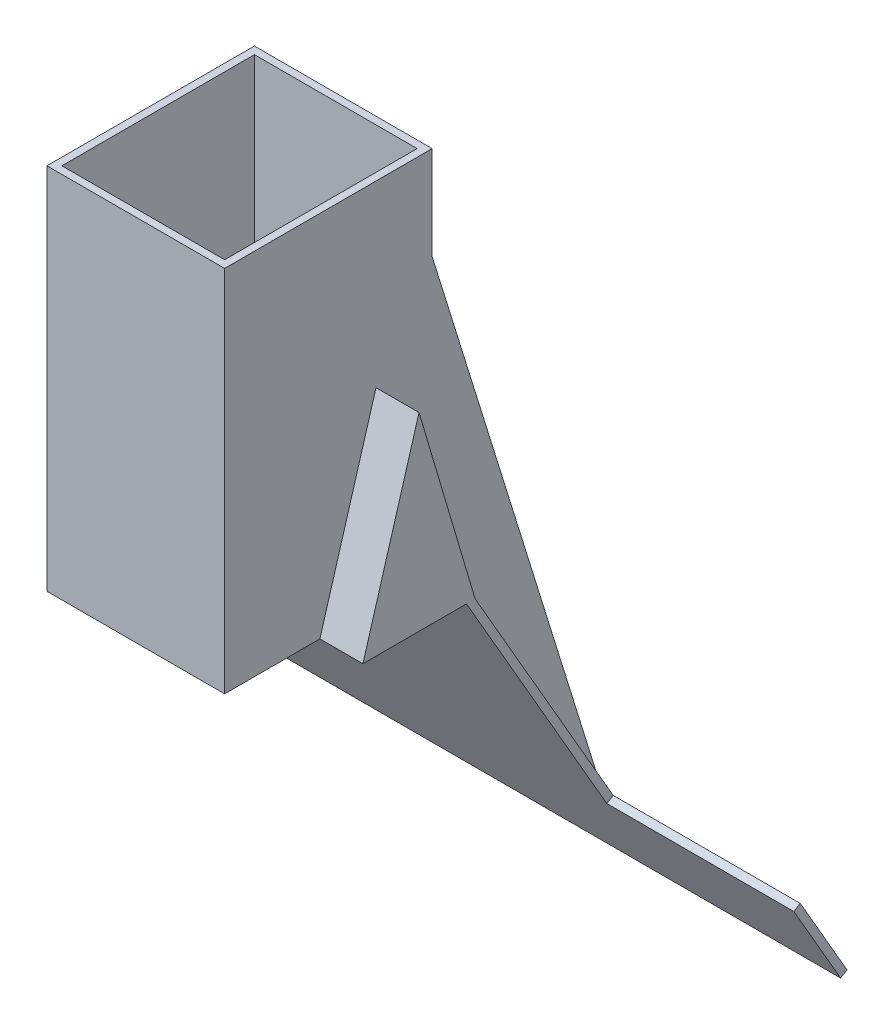
ISO-10303-21;
HEADER;
FILE_DESCRIPTION(('STEP AP214'),'2;1');
FILE_NAME('part.step','',(''),(''),'','','');
FILE_SCHEMA(('AUTOMOTIVE_DESIGN { 1 0 10303 214 1 1 1 1 }'));
ENDSEC;
DATA;
#1=APPLICATION_CONTEXT('core data for automotive mechanical design processes');
#2=APPLICATION_PROTOCOL_DEFINITION('international standard','automotive_design',2000,#1);
#3=PRODUCT_CONTEXT('',#1,'mechanical');
#4=PRODUCT('Part','Part','',(#3));
#5=PRODUCT_RELATED_PRODUCT_CATEGORY('part','',(#4));
#6=PRODUCT_DEFINITION_FORMATION('','',#4);
#7=PRODUCT_DEFINITION_CONTEXT('part definition',#1,'design');
#8=PRODUCT_DEFINITION('design','',#6,#7);
#9=PRODUCT_DEFINITION_SHAPE('','',#8);
#10=(LENGTH_UNIT() NAMED_UNIT(*) SI_UNIT(.MILLI.,.METRE.));
#11=(NAMED_UNIT(*) PLANE_ANGLE_UNIT() SI_UNIT($,.RADIAN.));
#12=(NAMED_UNIT(*) SI_UNIT($,.STERADIAN.) SOLID_ANGLE_UNIT());
#13=UNCERTAINTY_MEASURE_WITH_UNIT(LENGTH_MEASURE(1.E-05),#10,'distance_accuracy_value','');
#14=(GEOMETRIC_REPRESENTATION_CONTEXT(3) GLOBAL_UNCERTAINTY_ASSIGNED_CONTEXT((#13)) GLOBAL_UNIT_ASSIGNED_CONTEXT((#10,
#11,#12)) REPRESENTATION_CONTEXT('',''));
#15=CARTESIAN_POINT('',(0.,0.,0.));
#16=DIRECTION('',(0.,0.,1.));
#17=DIRECTION('',(1.,0.,0.));
#18=AXIS2_PLACEMENT_3D('',#15,#16,#17);
#19=CARTESIAN_POINT('',(11.8,0.,0.));
#20=DIRECTION('',(-1.,0.,0.));
#21=DIRECTION('',(0.,0.,-1.));
#22=AXIS2_PLACEMENT_3D('',#19,#20,#21);
#23=PLANE('',#22);
#24=DIRECTION('',(0.,-0.5,0.866025403784439));
#25=VECTOR('',#24,1.);
#26=CARTESIAN_POINT('',(11.8,-12.7903810567666,-18.4775299461621));
#27=LINE('',#26,#25);
#28=CARTESIAN_POINT('',(11.8,-12.7903810567666,-18.4775299461621));
#29=VERTEX_POINT('',#28);
#30=CARTESIAN_POINT('',(11.8,-12.9903810567666,-18.1311197846483));
#31=VERTEX_POINT('',#30);
#32=EDGE_CURVE('E57',#29,#31,#27,.T.);
#33=ORIENTED_EDGE('',*,*,#32,.F.);
#34=DIRECTION('',(0.,-0.866025403784438,-0.5));
#35=VECTOR('',#34,1.);
#36=CARTESIAN_POINT('',(11.8,-17.1205080756888,-20.9775299461621));
#37=LINE('',#36,#35);
#38=CARTESIAN_POINT('',(11.8,0.,-11.093));
#39=VERTEX_POINT('',#38);
#40=EDGE_CURVE('E364',#39,#29,#37,.T.);
#41=ORIENTED_EDGE('',*,*,#40,.F.);
#42=DIRECTION('',(0.,-0.958836299508464,-0.283959417426001));
#43=VECTOR('',#42,1.);
#44=CARTESIAN_POINT('',(11.8,0.,-11.093));
#45=LINE('',#44,#43);
#46=CARTESIAN_POINT('',(11.8,10.13,-8.093));
#47=VERTEX_POINT('',#46);
#48=EDGE_CURVE('E496',#47,#39,#45,.T.);
#49=ORIENTED_EDGE('',*,*,#48,.F.);
#50=DIRECTION('',(0.,0.958836299508464,-0.283959417426001));
#51=VECTOR('',#50,1.);
#52=CARTESIAN_POINT('',(11.8,10.13,-8.093));
#53=LINE('',#52,#51);
#54=CARTESIAN_POINT('',(11.8,0.,-5.093));
#55=VERTEX_POINT('',#54);
#56=EDGE_CURVE('E501',#55,#47,#53,.T.);
#57=ORIENTED_EDGE('',*,*,#56,.F.);
#58=DIRECTION('',(0.,0.,1.));
#59=VECTOR('',#58,1.);
#60=CARTESIAN_POINT('',(11.8,0.,-5.093));
#61=LINE('',#60,#59);
#62=CARTESIAN_POINT('',(11.8,0.,-10.6311197846483));
#63=VERTEX_POINT('',#62);
#64=EDGE_CURVE('E493',#63,#55,#61,.T.);
#65=ORIENTED_EDGE('',*,*,#64,.F.);
#66=DIRECTION('',(0.,0.866025403784439,0.5));
#67=VECTOR('',#66,1.);
#68=CARTESIAN_POINT('',(11.8,-17.3205080756888,-20.6311197846483));
#69=LINE('',#68,#67);
#70=EDGE_CURVE('E367',#31,#63,#69,.T.);
#71=ORIENTED_EDGE('',*,*,#70,.F.);
#72=EDGE_LOOP('',(#33,#41,#49,#57,#65,#71));
#73=FACE_BOUND('',#72,.T.);
#74=ADVANCED_FACE('F41',(#73),#23,.F.);
#75=CARTESIAN_POINT('',(9.1,19.7,-5.5));
#76=DIRECTION('',(0.,0.,-1.));
#77=DIRECTION('',(-1.,0.,0.));
#78=AXIS2_PLACEMENT_3D('',#75,#76,#77);
#79=PLANE('',#78);
#80=DIRECTION('',(0.,1.,0.));
#81=VECTOR('',#80,1.);
#82=CARTESIAN_POINT('',(0.4,-17.3215080756888,-5.5));
#83=LINE('',#82,#81);
#84=CARTESIAN_POINT('',(0.399999999999999,0.,-5.5));
#85=VERTEX_POINT('',#84);
#86=CARTESIAN_POINT('',(0.399999999999999,0.4,-5.5));
#87=VERTEX_POINT('',#86);
#88=EDGE_CURVE('E338',#85,#87,#83,.T.);
#89=ORIENTED_EDGE('',*,*,#88,.F.);
#90=DIRECTION('',(1.,0.,0.));
#91=VECTOR('',#90,1.);
#92=CARTESIAN_POINT('',(9.1,0.,-5.5));
#93=LINE('',#92,#91);
#94=CARTESIAN_POINT('',(-1.9,0.,-5.5));
#95=VERTEX_POINT('',#94);
#96=EDGE_CURVE('E557',#95,#85,#93,.T.);
#97=ORIENTED_EDGE('',*,*,#96,.F.);
#98=DIRECTION('',(0.,-1.,0.));
#99=VECTOR('',#98,1.);
#100=CARTESIAN_POINT('',(-1.9,0.4,-5.5));
#101=LINE('',#100,#99);
#102=CARTESIAN_POINT('',(-1.9,0.4,-5.5));
#103=VERTEX_POINT('',#102);
#104=EDGE_CURVE('E412',#103,#95,#101,.T.);
#105=ORIENTED_EDGE('',*,*,#104,.F.);
#106=DIRECTION('',(-1.,0.,0.));
#107=VECTOR('',#106,1.);
#108=CARTESIAN_POINT('',(-1.9,0.4,-5.5));
#109=LINE('',#108,#107);
#110=EDGE_CURVE('E398',#87,#103,#109,.T.);
#111=ORIENTED_EDGE('',*,*,#110,.F.);
#112=EDGE_LOOP('',(#89,#97,#105,#111));
#113=FACE_BOUND('',#112,.T.);
#114=ADVANCED_FACE('F709',(#113),#79,.T.);
#115=CARTESIAN_POINT('',(11.8,-17.1205080756888,-20.9775299461621));
#116=DIRECTION('',(0.,0.5,-0.866025403784439));
#117=DIRECTION('',(0.,0.866025403784439,0.5));
#118=AXIS2_PLACEMENT_3D('',#115,#116,#117);
#119=PLANE('',#118);
#120=DIRECTION('',(1.,0.,0.));
#121=VECTOR('',#120,1.);
#122=CARTESIAN_POINT('',(-2.3,0.,-11.093));
#123=LINE('',#122,#121);
#124=CARTESIAN_POINT('',(-2.3,0.,-11.093));
#125=VERTEX_POINT('',#124);
#126=CARTESIAN_POINT('',(0.,0.,-11.093));
#127=VERTEX_POINT('',#126);
#128=EDGE_CURVE('E533',#125,#127,#123,.T.);
#129=ORIENTED_EDGE('',*,*,#128,.T.);
#130=DIRECTION('',(0.,0.866025403784438,0.5));
#131=VECTOR('',#130,1.);
#132=CARTESIAN_POINT('',(0.,-17.1205080756888,-20.9775299461621));
#133=LINE('',#132,#131);
#134=CARTESIAN_POINT('',(0.,-17.1205080756888,-20.9775299461621));
#135=VERTEX_POINT('',#134);
#136=EDGE_CURVE('E349',#135,#127,#133,.T.);
#137=ORIENTED_EDGE('',*,*,#136,.F.);
#138=DIRECTION('',(-1.,0.,0.));
#139=VECTOR('',#138,1.);
#140=CARTESIAN_POINT('',(11.8,-17.1205080756888,-20.9775299461621));
#141=LINE('',#140,#139);
#142=CARTESIAN_POINT('',(-12.3,-17.1205080756888,-20.9775299461621));
#143=VERTEX_POINT('',#142);
#144=EDGE_CURVE('E283',#135,#143,#141,.T.);
#145=ORIENTED_EDGE('',*,*,#144,.T.);
#146=DIRECTION('',(0.,-0.866025403784438,-0.5));
#147=VECTOR('',#146,1.);
#148=CARTESIAN_POINT('',(-12.3,-17.1205080756888,-20.9775299461621));
#149=LINE('',#148,#147);
#150=CARTESIAN_POINT('',(-12.3,-12.7903810567666,-18.4775299461621));
#151=VERTEX_POINT('',#150);
#152=EDGE_CURVE('E317',#151,#143,#149,.T.);
#153=ORIENTED_EDGE('',*,*,#152,.F.);
#154=DIRECTION('',(-1.,0.,0.));
#155=VECTOR('',#154,1.);
#156=CARTESIAN_POINT('',(-2.3,-12.7903810567666,-18.4775299461621));
#157=LINE('',#156,#155);
#158=CARTESIAN_POINT('',(-2.3,-12.7903810567666,-18.4775299461621));
#159=VERTEX_POINT('',#158);
#160=EDGE_CURVE('E313',#159,#151,#157,.T.);
#161=ORIENTED_EDGE('',*,*,#160,.F.);
#162=DIRECTION('',(0.,-0.866025403784438,-0.5));
#163=VECTOR('',#162,1.);
#164=CARTESIAN_POINT('',(-2.3,-17.1205080756888,-20.9775299461621));
#165=LINE('',#164,#163);
#166=EDGE_CURVE('E361',#125,#159,#165,.T.);
#167=ORIENTED_EDGE('',*,*,#166,.F.);
#168=EDGE_LOOP('',(#129,#137,#145,#153,#161,#167));
#169=FACE_BOUND('',#168,.T.);
#170=ADVANCED_FACE('F665',(#169),#119,.T.);
#171=CARTESIAN_POINT('',(0.,19.7,0.));
#172=DIRECTION('',(1.,0.,0.));
#173=DIRECTION('',(0.,0.,-1.));
#174=AXIS2_PLACEMENT_3D('',#171,#172,#173);
#175=PLANE('',#174);
#176=DIRECTION('',(0.,-0.958836299508464,-0.283959417426001));
#177=VECTOR('',#176,1.);
#178=CARTESIAN_POINT('',(0.,0.,-11.093));
#179=LINE('',#178,#177);
#180=CARTESIAN_POINT('',(0.,10.13,-8.093));
#181=VERTEX_POINT('',#180);
#182=EDGE_CURVE('E526',#181,#127,#179,.T.);
#183=ORIENTED_EDGE('',*,*,#182,.F.);
#184=DIRECTION('',(0.,0.958836299508464,-0.283959417426001));
#185=VECTOR('',#184,1.);
#186=CARTESIAN_POINT('',(0.,10.13,-8.093));
#187=LINE('',#186,#185);
#188=CARTESIAN_POINT('',(0.,0.,-5.093));
#189=VERTEX_POINT('',#188);
#190=EDGE_CURVE('E521',#189,#181,#187,.T.);
#191=ORIENTED_EDGE('',*,*,#190,.F.);
#192=DIRECTION('',(0.,0.,1.));
#193=VECTOR('',#192,1.);
#194=CARTESIAN_POINT('',(0.,0.,0.));
#195=LINE('',#194,#193);
#196=CARTESIAN_POINT('',(0.,0.,0.));
#197=VERTEX_POINT('',#196);
#198=EDGE_CURVE('E598',#189,#197,#195,.T.);
#199=ORIENTED_EDGE('',*,*,#198,.T.);
#200=DIRECTION('',(0.,-1.,0.));
#201=VECTOR('',#200,1.);
#202=CARTESIAN_POINT('',(0.,19.7,0.));
#203=LINE('',#202,#201);
#204=CARTESIAN_POINT('',(0.,19.7,0.));
#205=VERTEX_POINT('',#204);
#206=EDGE_CURVE('E11',#205,#197,#203,.T.);
#207=ORIENTED_EDGE('',*,*,#206,.F.);
#208=DIRECTION('',(0.,0.,1.));
#209=VECTOR('',#208,1.);
#210=CARTESIAN_POINT('',(0.,19.7,0.));
#211=LINE('',#210,#209);
#212=CARTESIAN_POINT('',(0.,19.7,-11.093));
#213=VERTEX_POINT('',#212);
#214=EDGE_CURVE('E599',#213,#205,#211,.T.);
#215=ORIENTED_EDGE('',*,*,#214,.F.);
#216=DIRECTION('',(0.,-1.,0.));
#217=VECTOR('',#216,1.);
#218=CARTESIAN_POINT('',(0.,19.7,-11.093));
#219=LINE('',#218,#217);
#220=CARTESIAN_POINT('',(0.,14.7,-11.093));
#221=VERTEX_POINT('',#220);
#222=EDGE_CURVE('E613',#213,#221,#219,.T.);
#223=ORIENTED_EDGE('',*,*,#222,.T.);
#224=DIRECTION('',(0.,-0.954985944356835,-0.296651051036202));
#225=VECTOR('',#224,1.);
#226=CARTESIAN_POINT('',(0.,14.7,-11.093));
#227=LINE('',#226,#225);
#228=EDGE_CURVE('E341',#221,#135,#227,.T.);
#229=ORIENTED_EDGE('',*,*,#228,.T.);
#230=ORIENTED_EDGE('',*,*,#136,.T.);
#231=EDGE_LOOP('',(#183,#191,#199,#207,#215,#223,#229,#230));
#232=FACE_BOUND('',#231,.T.);
#233=ADVANCED_FACE('F43',(#232),#175,.F.);
#234=CARTESIAN_POINT('',(0.,19.7,0.));
#235=DIRECTION('',(0.,-1.,0.));
#236=DIRECTION('',(0.,0.,-1.));
#237=AXIS2_PLACEMENT_3D('',#234,#235,#236);
#238=PLANE('',#237);
#239=ORIENTED_EDGE('',*,*,#214,.T.);
#240=DIRECTION('',(1.,0.,0.));
#241=VECTOR('',#240,1.);
#242=CARTESIAN_POINT('',(0.,19.7,0.));
#243=LINE('',#242,#241);
#244=CARTESIAN_POINT('',(9.5,19.7,0.));
#245=VERTEX_POINT('',#244);
#246=EDGE_CURVE('E603',#205,#245,#243,.T.);
#247=ORIENTED_EDGE('',*,*,#246,.T.);
#248=DIRECTION('',(0.,0.,-1.));
#249=VECTOR('',#248,1.);
#250=CARTESIAN_POINT('',(9.5,19.7,0.));
#251=LINE('',#250,#249);
#252=CARTESIAN_POINT('',(9.5,19.7,-11.093));
#253=VERTEX_POINT('',#252);
#254=EDGE_CURVE('E607',#245,#253,#251,.T.);
#255=ORIENTED_EDGE('',*,*,#254,.T.);
#256=DIRECTION('',(-1.,0.,0.));
#257=VECTOR('',#256,1.);
#258=CARTESIAN_POINT('',(0.,19.7,-11.093));
#259=LINE('',#258,#257);
#260=EDGE_CURVE('E610',#253,#213,#259,.T.);
#261=ORIENTED_EDGE('',*,*,#260,.T.);
#262=EDGE_LOOP('',(#239,#247,#255,#261));
#263=FACE_BOUND('',#262,.T.);
#264=DIRECTION('',(0.,0.,1.));
#265=VECTOR('',#264,1.);
#266=CARTESIAN_POINT('',(0.4,19.7,-0.4));
#267=LINE('',#266,#265);
#268=CARTESIAN_POINT('',(0.4,19.7,-10.693));
#269=VERTEX_POINT('',#268);
#270=CARTESIAN_POINT('',(0.4,19.7,-0.4));
#271=VERTEX_POINT('',#270);
#272=EDGE_CURVE('E578',#269,#271,#267,.T.);
#273=ORIENTED_EDGE('',*,*,#272,.F.);
#274=DIRECTION('',(-1.,0.,0.));
#275=VECTOR('',#274,1.);
#276=CARTESIAN_POINT('',(0.4,19.7,-10.693));
#277=LINE('',#276,#275);
#278=CARTESIAN_POINT('',(9.1,19.7,-10.693));
#279=VERTEX_POINT('',#278);
#280=EDGE_CURVE('E551',#279,#269,#277,.T.);
#281=ORIENTED_EDGE('',*,*,#280,.F.);
#282=DIRECTION('',(0.,0.,-1.));
#283=VECTOR('',#282,1.);
#284=CARTESIAN_POINT('',(9.1,19.7,-0.4));
#285=LINE('',#284,#283);
#286=CARTESIAN_POINT('',(9.1,19.7,-0.4));
#287=VERTEX_POINT('',#286);
#288=EDGE_CURVE('E574',#287,#279,#285,.T.);
#289=ORIENTED_EDGE('',*,*,#288,.F.);
#290=DIRECTION('',(1.,0.,0.));
#291=VECTOR('',#290,1.);
#292=CARTESIAN_POINT('',(0.4,19.7,-0.4));
#293=LINE('',#292,#291);
#294=EDGE_CURVE('E571',#271,#287,#293,.T.);
#295=ORIENTED_EDGE('',*,*,#294,.F.);
#296=EDGE_LOOP('',(#273,#281,#289,#295));
#297=FACE_BOUND('',#296,.T.);
#298=ADVANCED_FACE('F697',(#263,#297),#238,.F.);
#299=CARTESIAN_POINT('',(0.,0.,0.));
#300=DIRECTION('',(0.,-1.,0.));
#301=DIRECTION('',(0.,0.,-1.));
#302=AXIS2_PLACEMENT_3D('',#299,#300,#301);
#303=PLANE('',#302);
#304=ORIENTED_EDGE('',*,*,#96,.T.);
#305=DIRECTION('',(0.,0.,1.));
#306=VECTOR('',#305,1.);
#307=CARTESIAN_POINT('',(0.4,0.,-0.4));
#308=LINE('',#307,#306);
#309=CARTESIAN_POINT('',(0.4,0.,-0.4));
#310=VERTEX_POINT('',#309);
#311=EDGE_CURVE('E575',#85,#310,#308,.T.);
#312=ORIENTED_EDGE('',*,*,#311,.T.);
#313=DIRECTION('',(1.,0.,0.));
#314=VECTOR('',#313,1.);
#315=CARTESIAN_POINT('',(0.4,0.,-0.4));
#316=LINE('',#315,#314);
#317=CARTESIAN_POINT('',(9.1,0.,-0.4));
#318=VERTEX_POINT('',#317);
#319=EDGE_CURVE('E570',#310,#318,#316,.T.);
#320=ORIENTED_EDGE('',*,*,#319,.T.);
#321=DIRECTION('',(0.,0.,-1.));
#322=VECTOR('',#321,1.);
#323=CARTESIAN_POINT('',(9.1,0.,-0.4));
#324=LINE('',#323,#322);
#325=CARTESIAN_POINT('',(9.1,0.,-5.5));
#326=VERTEX_POINT('',#325);
#327=EDGE_CURVE('E585',#318,#326,#324,.T.);
#328=ORIENTED_EDGE('',*,*,#327,.T.);
#329=CARTESIAN_POINT('',(11.4,0.,-5.5));
#330=VERTEX_POINT('',#329);
#331=EDGE_CURVE('E550',#326,#330,#93,.T.);
#332=ORIENTED_EDGE('',*,*,#331,.T.);
#333=DIRECTION('',(0.,0.,1.));
#334=VECTOR('',#333,1.);
#335=CARTESIAN_POINT('',(11.4,0.,-5.5));
#336=LINE('',#335,#334);
#337=CARTESIAN_POINT('',(11.4,0.,-10.6311197846483));
#338=VERTEX_POINT('',#337);
#339=EDGE_CURVE('E408',#338,#330,#336,.T.);
#340=ORIENTED_EDGE('',*,*,#339,.F.);
#341=DIRECTION('',(-1.,0.,0.));
#342=VECTOR('',#341,1.);
#343=CARTESIAN_POINT('',(11.8,0.,-10.6311197846483));
#344=LINE('',#343,#342);
#345=EDGE_CURVE('E376',#63,#338,#344,.T.);
#346=ORIENTED_EDGE('',*,*,#345,.F.);
#347=ORIENTED_EDGE('',*,*,#64,.T.);
#348=DIRECTION('',(-1.,0.,0.));
#349=VECTOR('',#348,1.);
#350=CARTESIAN_POINT('',(11.8,0.,-5.093));
#351=LINE('',#350,#349);
#352=CARTESIAN_POINT('',(9.5,0.,-5.093));
#353=VERTEX_POINT('',#352);
#354=EDGE_CURVE('E505',#55,#353,#351,.T.);
#355=ORIENTED_EDGE('',*,*,#354,.T.);
#356=DIRECTION('',(0.,0.,-1.));
#357=VECTOR('',#356,1.);
#358=CARTESIAN_POINT('',(9.5,0.,0.));
#359=LINE('',#358,#357);
#360=CARTESIAN_POINT('',(9.5,0.,0.));
#361=VERTEX_POINT('',#360);
#362=EDGE_CURVE('E604',#361,#353,#359,.T.);
#363=ORIENTED_EDGE('',*,*,#362,.F.);
#364=DIRECTION('',(1.,0.,0.));
#365=VECTOR('',#364,1.);
#366=CARTESIAN_POINT('',(0.,0.,0.));
#367=LINE('',#366,#365);
#368=EDGE_CURVE('E616',#197,#361,#367,.T.);
#369=ORIENTED_EDGE('',*,*,#368,.F.);
#370=ORIENTED_EDGE('',*,*,#198,.F.);
#371=DIRECTION('',(1.,0.,0.));
#372=VECTOR('',#371,1.);
#373=CARTESIAN_POINT('',(-2.3,0.,-5.093));
#374=LINE('',#373,#372);
#375=CARTESIAN_POINT('',(-2.3,0.,-5.093));
#376=VERTEX_POINT('',#375);
#377=EDGE_CURVE('E546',#376,#189,#374,.T.);
#378=ORIENTED_EDGE('',*,*,#377,.F.);
#379=DIRECTION('',(0.,0.,1.));
#380=VECTOR('',#379,1.);
#381=CARTESIAN_POINT('',(-2.3,0.,-5.093));
#382=LINE('',#381,#380);
#383=CARTESIAN_POINT('',(-2.3,0.,-10.6311197846483));
#384=VERTEX_POINT('',#383);
#385=EDGE_CURVE('E522',#384,#376,#382,.T.);
#386=ORIENTED_EDGE('',*,*,#385,.F.);
#387=CARTESIAN_POINT('',(-1.9,0.,-10.6311197846483));
#388=VERTEX_POINT('',#387);
#389=EDGE_CURVE('E382',#388,#384,#344,.T.);
#390=ORIENTED_EDGE('',*,*,#389,.F.);
#391=DIRECTION('',(0.,0.,-1.));
#392=VECTOR('',#391,1.);
#393=CARTESIAN_POINT('',(-1.9,0.,-5.5));
#394=LINE('',#393,#392);
#395=EDGE_CURVE('E404',#95,#388,#394,.T.);
#396=ORIENTED_EDGE('',*,*,#395,.F.);
#397=EDGE_LOOP('',(#304,#312,#320,#328,#332,#340,#346,#347,#355,#363,#369,#370,#378,#386,#390,#396));
#398=FACE_BOUND('',#397,.T.);
#399=ADVANCED_FACE('F638',(#398),#303,.T.);
#400=CARTESIAN_POINT('',(0.,19.7,0.));
#401=DIRECTION('',(0.,0.,-1.));
#402=DIRECTION('',(-1.,0.,0.));
#403=AXIS2_PLACEMENT_3D('',#400,#401,#402);
#404=PLANE('',#403);
#405=ORIENTED_EDGE('',*,*,#368,.T.);
#406=DIRECTION('',(0.,-1.,0.));
#407=VECTOR('',#406,1.);
#408=CARTESIAN_POINT('',(9.5,19.7,0.));
#409=LINE('',#408,#407);
#410=EDGE_CURVE('E50',#245,#361,#409,.T.);
#411=ORIENTED_EDGE('',*,*,#410,.F.);
#412=ORIENTED_EDGE('',*,*,#246,.F.);
#413=ORIENTED_EDGE('',*,*,#206,.T.);
#414=EDGE_LOOP('',(#405,#411,#412,#413));
#415=FACE_BOUND('',#414,.T.);
#416=ADVANCED_FACE('F699',(#415),#404,.F.);
#417=CARTESIAN_POINT('',(9.5,19.7,0.));
#418=DIRECTION('',(-1.,0.,0.));
#419=DIRECTION('',(0.,0.,1.));
#420=AXIS2_PLACEMENT_3D('',#417,#418,#419);
#421=PLANE('',#420);
#422=ORIENTED_EDGE('',*,*,#362,.T.);
#423=DIRECTION('',(0.,0.958836299508464,-0.283959417426001));
#424=VECTOR('',#423,1.);
#425=CARTESIAN_POINT('',(9.5,10.13,-8.093));
#426=LINE('',#425,#424);
#427=CARTESIAN_POINT('',(9.5,10.13,-8.093));
#428=VERTEX_POINT('',#427);
#429=EDGE_CURVE('E497',#353,#428,#426,.T.);
#430=ORIENTED_EDGE('',*,*,#429,.T.);
#431=DIRECTION('',(0.,-0.958836299508464,-0.283959417426001));
#432=VECTOR('',#431,1.);
#433=CARTESIAN_POINT('',(9.5,0.,-11.093));
#434=LINE('',#433,#432);
#435=CARTESIAN_POINT('',(9.5,0.,-11.093));
#436=VERTEX_POINT('',#435);
#437=EDGE_CURVE('E492',#428,#436,#434,.T.);
#438=ORIENTED_EDGE('',*,*,#437,.T.);
#439=DIRECTION('',(0.,0.866025403784438,0.5));
#440=VECTOR('',#439,1.);
#441=CARTESIAN_POINT('',(9.5,-17.1205080756888,-20.9775299461621));
#442=LINE('',#441,#440);
#443=CARTESIAN_POINT('',(9.5,-17.1205080756888,-20.9775299461621));
#444=VERTEX_POINT('',#443);
#445=EDGE_CURVE('E348',#444,#436,#442,.T.);
#446=ORIENTED_EDGE('',*,*,#445,.F.);
#447=DIRECTION('',(0.,-0.954985944356835,-0.296651051036202));
#448=VECTOR('',#447,1.);
#449=CARTESIAN_POINT('',(9.5,14.7,-11.093));
#450=LINE('',#449,#448);
#451=CARTESIAN_POINT('',(9.5,14.7,-11.093));
#452=VERTEX_POINT('',#451);
#453=EDGE_CURVE('E344',#452,#444,#450,.T.);
#454=ORIENTED_EDGE('',*,*,#453,.F.);
#455=DIRECTION('',(0.,-1.,0.));
#456=VECTOR('',#455,1.);
#457=CARTESIAN_POINT('',(9.5,19.7,-11.093));
#458=LINE('',#457,#456);
#459=EDGE_CURVE('E625',#253,#452,#458,.T.);
#460=ORIENTED_EDGE('',*,*,#459,.F.);
#461=ORIENTED_EDGE('',*,*,#254,.F.);
#462=ORIENTED_EDGE('',*,*,#410,.T.);
#463=EDGE_LOOP('',(#422,#430,#438,#446,#454,#460,#461,#462));
#464=FACE_BOUND('',#463,.T.);
#465=ADVANCED_FACE('F633',(#464),#421,.F.);
#466=CARTESIAN_POINT('',(0.,19.7,-11.093));
#467=DIRECTION('',(0.,0.,1.));
#468=DIRECTION('',(1.,0.,0.));
#469=AXIS2_PLACEMENT_3D('',#466,#467,#468);
#470=PLANE('',#469);
#471=ORIENTED_EDGE('',*,*,#459,.T.);
#472=DIRECTION('',(-1.,0.,0.));
#473=VECTOR('',#472,1.);
#474=CARTESIAN_POINT('',(9.5,14.7,-11.093));
#475=LINE('',#474,#473);
#476=EDGE_CURVE('E358',#452,#221,#475,.T.);
#477=ORIENTED_EDGE('',*,*,#476,.T.);
#478=ORIENTED_EDGE('',*,*,#222,.F.);
#479=ORIENTED_EDGE('',*,*,#260,.F.);
#480=EDGE_LOOP('',(#471,#477,#478,#479));
#481=FACE_BOUND('',#480,.T.);
#482=ADVANCED_FACE('F695',(#481),#470,.F.);
#483=CARTESIAN_POINT('',(0.4,19.7,-0.4));
#484=DIRECTION('',(0.,0.,-1.));
#485=DIRECTION('',(-1.,0.,0.));
#486=AXIS2_PLACEMENT_3D('',#483,#484,#485);
#487=PLANE('',#486);
#488=ORIENTED_EDGE('',*,*,#319,.F.);
#489=DIRECTION('',(0.,-1.,0.));
#490=VECTOR('',#489,1.);
#491=CARTESIAN_POINT('',(0.4,19.7,-0.4));
#492=LINE('',#491,#490);
#493=EDGE_CURVE('E581',#271,#310,#492,.T.);
#494=ORIENTED_EDGE('',*,*,#493,.F.);
#495=ORIENTED_EDGE('',*,*,#294,.T.);
#496=DIRECTION('',(0.,-1.,0.));
#497=VECTOR('',#496,1.);
#498=CARTESIAN_POINT('',(9.1,19.7,-0.4));
#499=LINE('',#498,#497);
#500=EDGE_CURVE('E594',#287,#318,#499,.T.);
#501=ORIENTED_EDGE('',*,*,#500,.T.);
#502=EDGE_LOOP('',(#488,#494,#495,#501));
#503=FACE_BOUND('',#502,.T.);
#504=ADVANCED_FACE('F748',(#503),#487,.T.);
#505=CARTESIAN_POINT('',(9.1,19.7,-0.4));
#506=DIRECTION('',(-1.,0.,0.));
#507=DIRECTION('',(0.,0.,1.));
#508=AXIS2_PLACEMENT_3D('',#505,#506,#507);
#509=PLANE('',#508);
#510=ORIENTED_EDGE('',*,*,#327,.F.);
#511=ORIENTED_EDGE('',*,*,#500,.F.);
#512=ORIENTED_EDGE('',*,*,#288,.T.);
#513=DIRECTION('',(0.,-1.,0.));
#514=VECTOR('',#513,1.);
#515=CARTESIAN_POINT('',(9.1,19.7,-10.693));
#516=LINE('',#515,#514);
#517=CARTESIAN_POINT('',(9.1,0.4,-10.693));
#518=VERTEX_POINT('',#517);
#519=EDGE_CURVE('E566',#279,#518,#516,.T.);
#520=ORIENTED_EDGE('',*,*,#519,.T.);
#521=DIRECTION('',(0.,0.,1.));
#522=VECTOR('',#521,1.);
#523=CARTESIAN_POINT('',(9.1,0.400000000000001,-5.5));
#524=LINE('',#523,#522);
#525=CARTESIAN_POINT('',(9.1,0.400000000000001,-5.5));
#526=VERTEX_POINT('',#525);
#527=EDGE_CURVE('E416',#518,#526,#524,.T.);
#528=ORIENTED_EDGE('',*,*,#527,.T.);
#529=DIRECTION('',(0.,1.,0.));
#530=VECTOR('',#529,1.);
#531=CARTESIAN_POINT('',(9.1,-17.3215080756888,-5.5));
#532=LINE('',#531,#530);
#533=EDGE_CURVE('E332',#326,#526,#532,.T.);
#534=ORIENTED_EDGE('',*,*,#533,.F.);
#535=EDGE_LOOP('',(#510,#511,#512,#520,#528,#534));
#536=FACE_BOUND('',#535,.T.);
#537=DIRECTION('',(0.,0.958836299508465,-0.283959417426001));
#538=VECTOR('',#537,1.);
#539=CARTESIAN_POINT('',(9.1,18.10876123634,-10.8730828919585));
#540=LINE('',#539,#538);
#541=CARTESIAN_POINT('',(9.1,1.,-5.80632240735632));
#542=VERTEX_POINT('',#541);
#543=CARTESIAN_POINT('',(9.1,8.7213480044935,-8.093));
#544=VERTEX_POINT('',#543);
#545=EDGE_CURVE('E485',#542,#544,#540,.T.);
#546=ORIENTED_EDGE('',*,*,#545,.F.);
#547=DIRECTION('',(0.,0.,1.));
#548=VECTOR('',#547,1.);
#549=CARTESIAN_POINT('',(9.1,1.,-5.5));
#550=LINE('',#549,#548);
#551=CARTESIAN_POINT('',(9.1,1.,-10.3796775926437));
#552=VERTEX_POINT('',#551);
#553=EDGE_CURVE('E478',#552,#542,#550,.T.);
#554=ORIENTED_EDGE('',*,*,#553,.F.);
#555=DIRECTION('',(0.,-0.958836299508465,-0.283959417426001));
#556=VECTOR('',#555,1.);
#557=CARTESIAN_POINT('',(9.1,19.5207565524615,-4.89475462547838));
#558=LINE('',#557,#556);
#559=EDGE_CURVE('E463',#544,#552,#558,.T.);
#560=ORIENTED_EDGE('',*,*,#559,.F.);
#561=EDGE_LOOP('',(#546,#554,#560));
#562=FACE_BOUND('',#561,.T.);
#563=ADVANCED_FACE('F744',(#536,#562),#509,.T.);
#564=CARTESIAN_POINT('',(0.4,19.7,-0.4));
#565=DIRECTION('',(1.,0.,0.));
#566=DIRECTION('',(0.,0.,-1.));
#567=AXIS2_PLACEMENT_3D('',#564,#565,#566);
#568=PLANE('',#567);
#569=ORIENTED_EDGE('',*,*,#311,.F.);
#570=ORIENTED_EDGE('',*,*,#88,.T.);
#571=DIRECTION('',(0.,0.,-1.));
#572=VECTOR('',#571,1.);
#573=CARTESIAN_POINT('',(0.399999999999999,0.400000000000001,-5.5));
#574=LINE('',#573,#572);
#575=CARTESIAN_POINT('',(0.4,0.400000000000001,-10.693));
#576=VERTEX_POINT('',#575);
#577=EDGE_CURVE('E431',#87,#576,#574,.T.);
#578=ORIENTED_EDGE('',*,*,#577,.T.);
#579=DIRECTION('',(0.,-1.,0.));
#580=VECTOR('',#579,1.);
#581=CARTESIAN_POINT('',(0.4,19.7,-10.693));
#582=LINE('',#581,#580);
#583=EDGE_CURVE('E555',#269,#576,#582,.T.);
#584=ORIENTED_EDGE('',*,*,#583,.F.);
#585=ORIENTED_EDGE('',*,*,#272,.T.);
#586=ORIENTED_EDGE('',*,*,#493,.T.);
#587=EDGE_LOOP('',(#569,#570,#578,#584,#585,#586));
#588=FACE_BOUND('',#587,.T.);
#589=DIRECTION('',(0.,-0.958836299508465,0.283959417426001));
#590=VECTOR('',#589,1.);
#591=CARTESIAN_POINT('',(0.4,18.10876123634,-10.8730828919585));
#592=LINE('',#591,#590);
#593=CARTESIAN_POINT('',(0.399999999999999,8.7213480044935,-8.093));
#594=VERTEX_POINT('',#593);
#595=CARTESIAN_POINT('',(0.399999999999999,1.,-5.80632240735632));
#596=VERTEX_POINT('',#595);
#597=EDGE_CURVE('E489',#594,#596,#592,.T.);
#598=ORIENTED_EDGE('',*,*,#597,.F.);
#599=DIRECTION('',(0.,0.958836299508465,0.283959417426001));
#600=VECTOR('',#599,1.);
#601=CARTESIAN_POINT('',(0.399999999999999,19.5207565524615,-4.89475462547838));
#602=LINE('',#601,#600);
#603=CARTESIAN_POINT('',(0.4,0.999999999999997,-10.3796775926437));
#604=VERTEX_POINT('',#603);
#605=EDGE_CURVE('E475',#604,#594,#602,.T.);
#606=ORIENTED_EDGE('',*,*,#605,.F.);
#607=DIRECTION('',(0.,0.,-1.));
#608=VECTOR('',#607,1.);
#609=CARTESIAN_POINT('',(0.399999999999999,1.,-5.5));
#610=LINE('',#609,#608);
#611=EDGE_CURVE('E481',#596,#604,#610,.T.);
#612=ORIENTED_EDGE('',*,*,#611,.F.);
#613=EDGE_LOOP('',(#598,#606,#612));
#614=FACE_BOUND('',#613,.T.);
#615=ADVANCED_FACE('F740',(#588,#614),#568,.T.);
#616=ORIENTED_EDGE('',*,*,#533,.T.);
#617=CARTESIAN_POINT('',(11.4,0.4,-5.5));
#618=VERTEX_POINT('',#617);
#619=EDGE_CURVE('E399',#618,#526,#109,.T.);
#620=ORIENTED_EDGE('',*,*,#619,.F.);
#621=DIRECTION('',(0.,-1.,0.));
#622=VECTOR('',#621,1.);
#623=CARTESIAN_POINT('',(11.4,0.4,-5.5));
#624=LINE('',#623,#622);
#625=EDGE_CURVE('E417',#618,#330,#624,.T.);
#626=ORIENTED_EDGE('',*,*,#625,.T.);
#627=ORIENTED_EDGE('',*,*,#331,.F.);
#628=EDGE_LOOP('',(#616,#620,#626,#627));
#629=FACE_BOUND('',#628,.T.);
#630=ADVANCED_FACE('F718',(#629),#79,.T.);
#631=CARTESIAN_POINT('',(0.4,19.7,-10.693));
#632=DIRECTION('',(0.,0.,1.));
#633=DIRECTION('',(1.,0.,0.));
#634=AXIS2_PLACEMENT_3D('',#631,#632,#633);
#635=PLANE('',#634);
#636=DIRECTION('',(-1.,0.,0.));
#637=VECTOR('',#636,1.);
#638=CARTESIAN_POINT('',(0.4,0.,-10.693));
#639=LINE('',#638,#637);
#640=CARTESIAN_POINT('',(11.4,0.,-10.693));
#641=VERTEX_POINT('',#640);
#642=CARTESIAN_POINT('',(-1.9,0.,-10.693));
#643=VERTEX_POINT('',#642);
#644=EDGE_CURVE('E556',#641,#643,#639,.T.);
#645=ORIENTED_EDGE('',*,*,#644,.F.);
#646=DIRECTION('',(0.,-1.,0.));
#647=VECTOR('',#646,1.);
#648=CARTESIAN_POINT('',(11.4,0.4,-10.693));
#649=LINE('',#648,#647);
#650=CARTESIAN_POINT('',(11.4,0.4,-10.693));
#651=VERTEX_POINT('',#650);
#652=EDGE_CURVE('E421',#651,#641,#649,.T.);
#653=ORIENTED_EDGE('',*,*,#652,.F.);
#654=DIRECTION('',(1.,0.,0.));
#655=VECTOR('',#654,1.);
#656=CARTESIAN_POINT('',(-1.9,0.4,-10.693));
#657=LINE('',#656,#655);
#658=EDGE_CURVE('E389',#518,#651,#657,.T.);
#659=ORIENTED_EDGE('',*,*,#658,.F.);
#660=ORIENTED_EDGE('',*,*,#519,.F.);
#661=ORIENTED_EDGE('',*,*,#280,.T.);
#662=ORIENTED_EDGE('',*,*,#583,.T.);
#663=CARTESIAN_POINT('',(-1.9,0.4,-10.693));
#664=VERTEX_POINT('',#663);
#665=EDGE_CURVE('E391',#664,#576,#657,.T.);
#666=ORIENTED_EDGE('',*,*,#665,.F.);
#667=DIRECTION('',(0.,-1.,0.));
#668=VECTOR('',#667,1.);
#669=CARTESIAN_POINT('',(-1.9,0.4,-10.693));
#670=LINE('',#669,#668);
#671=EDGE_CURVE('E403',#664,#643,#670,.T.);
#672=ORIENTED_EDGE('',*,*,#671,.T.);
#673=EDGE_LOOP('',(#645,#653,#659,#660,#661,#662,#666,#672));
#674=FACE_BOUND('',#673,.T.);
#675=ADVANCED_FACE('F735',(#674),#635,.T.);
#676=CARTESIAN_POINT('',(-2.3,10.13,-8.093));
#677=DIRECTION('',(0.,-0.283959417426001,-0.958836299508465));
#678=DIRECTION('',(0.,0.958836299508465,-0.283959417426001));
#679=AXIS2_PLACEMENT_3D('',#676,#677,#678);
#680=PLANE('',#679);
#681=ORIENTED_EDGE('',*,*,#190,.T.);
#682=DIRECTION('',(1.,0.,0.));
#683=VECTOR('',#682,1.);
#684=CARTESIAN_POINT('',(-2.3,10.13,-8.093));
#685=LINE('',#684,#683);
#686=CARTESIAN_POINT('',(-2.3,10.13,-8.093));
#687=VERTEX_POINT('',#686);
#688=EDGE_CURVE('E542',#687,#181,#685,.T.);
#689=ORIENTED_EDGE('',*,*,#688,.F.);
#690=DIRECTION('',(0.,0.958836299508464,-0.283959417426001));
#691=VECTOR('',#690,1.);
#692=CARTESIAN_POINT('',(-2.3,10.13,-8.093));
#693=LINE('',#692,#691);
#694=EDGE_CURVE('E525',#376,#687,#693,.T.);
#695=ORIENTED_EDGE('',*,*,#694,.F.);
#696=ORIENTED_EDGE('',*,*,#377,.T.);
#697=EDGE_LOOP('',(#681,#689,#695,#696));
#698=FACE_BOUND('',#697,.T.);
#699=ADVANCED_FACE('F680',(#698),#680,.F.);
#700=CARTESIAN_POINT('',(-2.3,0.,-11.093));
#701=DIRECTION('',(0.,-0.283959417426001,0.958836299508465));
#702=DIRECTION('',(0.,-0.958836299508465,-0.283959417426001));
#703=AXIS2_PLACEMENT_3D('',#700,#701,#702);
#704=PLANE('',#703);
#705=ORIENTED_EDGE('',*,*,#182,.T.);
#706=ORIENTED_EDGE('',*,*,#128,.F.);
#707=DIRECTION('',(0.,-0.958836299508464,-0.283959417426001));
#708=VECTOR('',#707,1.);
#709=CARTESIAN_POINT('',(-2.3,0.,-11.093));
#710=LINE('',#709,#708);
#711=EDGE_CURVE('E529',#687,#125,#710,.T.);
#712=ORIENTED_EDGE('',*,*,#711,.F.);
#713=ORIENTED_EDGE('',*,*,#688,.T.);
#714=EDGE_LOOP('',(#705,#706,#712,#713));
#715=FACE_BOUND('',#714,.T.);
#716=ADVANCED_FACE('F684',(#715),#704,.F.);
#717=CARTESIAN_POINT('',(-2.3,0.,0.));
#718=DIRECTION('',(1.,0.,0.));
#719=DIRECTION('',(0.,0.,-1.));
#720=AXIS2_PLACEMENT_3D('',#717,#718,#719);
#721=PLANE('',#720);
#722=DIRECTION('',(0.,-0.958836299508465,-0.283959417426001));
#723=VECTOR('',#722,1.);
#724=CARTESIAN_POINT('',(-2.3,8.7213480044935,-8.093));
#725=LINE('',#724,#723);
#726=CARTESIAN_POINT('',(-2.3,8.7213480044935,-8.093));
#727=VERTEX_POINT('',#726);
#728=CARTESIAN_POINT('',(-2.3,1.,-10.3796775926437));
#729=VERTEX_POINT('',#728);
#730=EDGE_CURVE('E452',#727,#729,#725,.T.);
#731=ORIENTED_EDGE('',*,*,#730,.F.);
#732=DIRECTION('',(0.,0.958836299508465,-0.283959417426001));
#733=VECTOR('',#732,1.);
#734=CARTESIAN_POINT('',(-2.3,1.,-5.80632240735632));
#735=LINE('',#734,#733);
#736=CARTESIAN_POINT('',(-2.3,1.,-5.80632240735632));
#737=VERTEX_POINT('',#736);
#738=EDGE_CURVE('E435',#737,#727,#735,.T.);
#739=ORIENTED_EDGE('',*,*,#738,.F.);
#740=DIRECTION('',(0.,0.,1.));
#741=VECTOR('',#740,1.);
#742=CARTESIAN_POINT('',(-2.3,1.,-10.3796775926437));
#743=LINE('',#742,#741);
#744=EDGE_CURVE('E441',#729,#737,#743,.T.);
#745=ORIENTED_EDGE('',*,*,#744,.F.);
#746=EDGE_LOOP('',(#731,#739,#745));
#747=FACE_BOUND('',#746,.T.);
#748=ORIENTED_EDGE('',*,*,#166,.T.);
#749=DIRECTION('',(0.,-0.5,0.866025403784439));
#750=VECTOR('',#749,1.);
#751=CARTESIAN_POINT('',(-2.3,-12.7903810567666,-18.4775299461621));
#752=LINE('',#751,#750);
#753=CARTESIAN_POINT('',(-2.3,-12.9903810567666,-18.1311197846483));
#754=VERTEX_POINT('',#753);
#755=EDGE_CURVE('E322',#159,#754,#752,.T.);
#756=ORIENTED_EDGE('',*,*,#755,.T.);
#757=DIRECTION('',(0.,0.866025403784439,0.5));
#758=VECTOR('',#757,1.);
#759=CARTESIAN_POINT('',(-2.3,-17.3205080756888,-20.6311197846483));
#760=LINE('',#759,#758);
#761=EDGE_CURVE('E368',#754,#384,#760,.T.);
#762=ORIENTED_EDGE('',*,*,#761,.T.);
#763=ORIENTED_EDGE('',*,*,#385,.T.);
#764=ORIENTED_EDGE('',*,*,#694,.T.);
#765=ORIENTED_EDGE('',*,*,#711,.T.);
#766=EDGE_LOOP('',(#748,#756,#762,#763,#764,#765));
#767=FACE_BOUND('',#766,.T.);
#768=ADVANCED_FACE('F669',(#747,#767),#721,.F.);
#769=CARTESIAN_POINT('',(11.8,0.,-11.093));
#770=DIRECTION('',(0.,0.283959417426001,-0.958836299508465));
#771=DIRECTION('',(0.,0.958836299508465,0.283959417426001));
#772=AXIS2_PLACEMENT_3D('',#769,#770,#771);
#773=PLANE('',#772);
#774=ORIENTED_EDGE('',*,*,#437,.F.);
#775=DIRECTION('',(-1.,0.,0.));
#776=VECTOR('',#775,1.);
#777=CARTESIAN_POINT('',(11.8,10.13,-8.093));
#778=LINE('',#777,#776);
#779=EDGE_CURVE('E514',#47,#428,#778,.T.);
#780=ORIENTED_EDGE('',*,*,#779,.F.);
#781=ORIENTED_EDGE('',*,*,#48,.T.);
#782=DIRECTION('',(-1.,0.,0.));
#783=VECTOR('',#782,1.);
#784=CARTESIAN_POINT('',(11.8,0.,-11.093));
#785=LINE('',#784,#783);
#786=EDGE_CURVE('E517',#39,#436,#785,.T.);
#787=ORIENTED_EDGE('',*,*,#786,.T.);
#788=EDGE_LOOP('',(#774,#780,#781,#787));
#789=FACE_BOUND('',#788,.T.);
#790=ADVANCED_FACE('F650',(#789),#773,.T.);
#791=CARTESIAN_POINT('',(11.8,10.13,-8.093));
#792=DIRECTION('',(0.,0.283959417426001,0.958836299508465));
#793=DIRECTION('',(0.,-0.958836299508465,0.283959417426001));
#794=AXIS2_PLACEMENT_3D('',#791,#792,#793);
#795=PLANE('',#794);
#796=ORIENTED_EDGE('',*,*,#429,.F.);
#797=ORIENTED_EDGE('',*,*,#354,.F.);
#798=ORIENTED_EDGE('',*,*,#56,.T.);
#799=ORIENTED_EDGE('',*,*,#779,.T.);
#800=EDGE_LOOP('',(#796,#797,#798,#799));
#801=FACE_BOUND('',#800,.T.);
#802=ADVANCED_FACE('F646',(#801),#795,.T.);
#803=CARTESIAN_POINT('',(11.4,8.7213480044935,-8.093));
#804=DIRECTION('',(0.,0.283959417426001,-0.958836299508465));
#805=DIRECTION('',(0.,0.958836299508465,0.283959417426001));
#806=AXIS2_PLACEMENT_3D('',#803,#804,#805);
#807=PLANE('',#806);
#808=ORIENTED_EDGE('',*,*,#605,.T.);
#809=DIRECTION('',(-1.,0.,0.));
#810=VECTOR('',#809,1.);
#811=CARTESIAN_POINT('',(11.4,8.7213480044935,-8.093));
#812=LINE('',#811,#810);
#813=EDGE_CURVE('E449',#594,#727,#812,.T.);
#814=ORIENTED_EDGE('',*,*,#813,.T.);
#815=ORIENTED_EDGE('',*,*,#730,.T.);
#816=DIRECTION('',(-1.,0.,0.));
#817=VECTOR('',#816,1.);
#818=CARTESIAN_POINT('',(11.4,1.,-10.3796775926437));
#819=LINE('',#818,#817);
#820=EDGE_CURVE('E469',#604,#729,#819,.T.);
#821=ORIENTED_EDGE('',*,*,#820,.F.);
#822=EDGE_LOOP('',(#808,#814,#815,#821));
#823=FACE_BOUND('',#822,.T.);
#824=ADVANCED_FACE('F725',(#823),#807,.F.);
#825=CARTESIAN_POINT('',(11.4,1.,-10.3796775926437));
#826=DIRECTION('',(0.,-1.,0.));
#827=DIRECTION('',(0.,0.,-1.));
#828=AXIS2_PLACEMENT_3D('',#825,#826,#827);
#829=PLANE('',#828);
#830=ORIENTED_EDGE('',*,*,#611,.T.);
#831=ORIENTED_EDGE('',*,*,#820,.T.);
#832=ORIENTED_EDGE('',*,*,#744,.T.);
#833=DIRECTION('',(-1.,0.,0.));
#834=VECTOR('',#833,1.);
#835=CARTESIAN_POINT('',(11.4,1.,-5.80632240735632));
#836=LINE('',#835,#834);
#837=EDGE_CURVE('E464',#596,#737,#836,.T.);
#838=ORIENTED_EDGE('',*,*,#837,.F.);
#839=EDGE_LOOP('',(#830,#831,#832,#838));
#840=FACE_BOUND('',#839,.T.);
#841=ADVANCED_FACE('F813',(#840),#829,.F.);
#842=CARTESIAN_POINT('',(11.4,1.,-5.80632240735632));
#843=DIRECTION('',(0.,0.283959417426001,0.958836299508465));
#844=DIRECTION('',(0.,-0.958836299508465,0.283959417426001));
#845=AXIS2_PLACEMENT_3D('',#842,#843,#844);
#846=PLANE('',#845);
#847=ORIENTED_EDGE('',*,*,#597,.T.);
#848=ORIENTED_EDGE('',*,*,#837,.T.);
#849=ORIENTED_EDGE('',*,*,#738,.T.);
#850=ORIENTED_EDGE('',*,*,#813,.F.);
#851=EDGE_LOOP('',(#847,#848,#849,#850));
#852=FACE_BOUND('',#851,.T.);
#853=ADVANCED_FACE('F821',(#852),#846,.F.);
#854=ORIENTED_EDGE('',*,*,#545,.T.);
#855=CARTESIAN_POINT('',(11.4,8.7213480044935,-8.093));
#856=VERTEX_POINT('',#855);
#857=EDGE_CURVE('E470',#856,#544,#812,.T.);
#858=ORIENTED_EDGE('',*,*,#857,.F.);
#859=DIRECTION('',(0.,0.958836299508465,-0.283959417426001));
#860=VECTOR('',#859,1.);
#861=CARTESIAN_POINT('',(11.4,1.,-5.80632240735632));
#862=LINE('',#861,#860);
#863=CARTESIAN_POINT('',(11.4,1.,-5.80632240735632));
#864=VERTEX_POINT('',#863);
#865=EDGE_CURVE('E436',#864,#856,#862,.T.);
#866=ORIENTED_EDGE('',*,*,#865,.F.);
#867=EDGE_CURVE('E459',#864,#542,#836,.T.);
#868=ORIENTED_EDGE('',*,*,#867,.T.);
#869=EDGE_LOOP('',(#854,#858,#866,#868));
#870=FACE_BOUND('',#869,.T.);
#871=ADVANCED_FACE('F721',(#870),#846,.F.);
#872=ORIENTED_EDGE('',*,*,#553,.T.);
#873=ORIENTED_EDGE('',*,*,#867,.F.);
#874=DIRECTION('',(0.,0.,1.));
#875=VECTOR('',#874,1.);
#876=CARTESIAN_POINT('',(11.4,1.,-10.3796775926437));
#877=LINE('',#876,#875);
#878=CARTESIAN_POINT('',(11.4,1.,-10.3796775926437));
#879=VERTEX_POINT('',#878);
#880=EDGE_CURVE('E445',#879,#864,#877,.T.);
#881=ORIENTED_EDGE('',*,*,#880,.F.);
#882=EDGE_CURVE('E465',#879,#552,#819,.T.);
#883=ORIENTED_EDGE('',*,*,#882,.T.);
#884=EDGE_LOOP('',(#872,#873,#881,#883));
#885=FACE_BOUND('',#884,.T.);
#886=ADVANCED_FACE('F824',(#885),#829,.F.);
#887=ORIENTED_EDGE('',*,*,#559,.T.);
#888=ORIENTED_EDGE('',*,*,#882,.F.);
#889=DIRECTION('',(0.,-0.958836299508465,-0.283959417426001));
#890=VECTOR('',#889,1.);
#891=CARTESIAN_POINT('',(11.4,8.7213480044935,-8.093));
#892=LINE('',#891,#890);
#893=EDGE_CURVE('E440',#856,#879,#892,.T.);
#894=ORIENTED_EDGE('',*,*,#893,.F.);
#895=ORIENTED_EDGE('',*,*,#857,.T.);
#896=EDGE_LOOP('',(#887,#888,#894,#895));
#897=FACE_BOUND('',#896,.T.);
#898=ADVANCED_FACE('F815',(#897),#807,.F.);
#899=CARTESIAN_POINT('',(11.4,0.,0.));
#900=DIRECTION('',(1.,0.,0.));
#901=DIRECTION('',(0.,0.,-1.));
#902=AXIS2_PLACEMENT_3D('',#899,#900,#901);
#903=PLANE('',#902);
#904=ORIENTED_EDGE('',*,*,#865,.T.);
#905=ORIENTED_EDGE('',*,*,#893,.T.);
#906=ORIENTED_EDGE('',*,*,#880,.T.);
#907=EDGE_LOOP('',(#904,#905,#906));
#908=FACE_BOUND('',#907,.T.);
#909=ADVANCED_FACE('F848',(#908),#903,.F.);
#910=CARTESIAN_POINT('',(0.,0.4,0.));
#911=DIRECTION('',(0.,-1.,0.));
#912=DIRECTION('',(0.,0.,-1.));
#913=AXIS2_PLACEMENT_3D('',#910,#911,#912);
#914=PLANE('',#913);
#915=ORIENTED_EDGE('',*,*,#658,.T.);
#916=DIRECTION('',(0.,0.,1.));
#917=VECTOR('',#916,1.);
#918=CARTESIAN_POINT('',(11.4,0.4,-5.5));
#919=LINE('',#918,#917);
#920=EDGE_CURVE('E394',#651,#618,#919,.T.);
#921=ORIENTED_EDGE('',*,*,#920,.T.);
#922=ORIENTED_EDGE('',*,*,#619,.T.);
#923=ORIENTED_EDGE('',*,*,#527,.F.);
#924=EDGE_LOOP('',(#915,#921,#922,#923));
#925=FACE_BOUND('',#924,.T.);
#926=ADVANCED_FACE('F854',(#925),#914,.T.);
#927=CARTESIAN_POINT('',(11.4,0.4,-5.5));
#928=DIRECTION('',(1.,0.,0.));
#929=DIRECTION('',(0.,0.,-1.));
#930=AXIS2_PLACEMENT_3D('',#927,#928,#929);
#931=PLANE('',#930);
#932=EDGE_CURVE('E390',#641,#338,#336,.T.);
#933=ORIENTED_EDGE('',*,*,#932,.T.);
#934=ORIENTED_EDGE('',*,*,#339,.T.);
#935=ORIENTED_EDGE('',*,*,#625,.F.);
#936=ORIENTED_EDGE('',*,*,#920,.F.);
#937=ORIENTED_EDGE('',*,*,#652,.T.);
#938=EDGE_LOOP('',(#933,#934,#935,#936,#937));
#939=FACE_BOUND('',#938,.T.);
#940=ADVANCED_FACE('F861',(#939),#931,.F.);
#941=ORIENTED_EDGE('',*,*,#110,.T.);
#942=DIRECTION('',(0.,0.,-1.));
#943=VECTOR('',#942,1.);
#944=CARTESIAN_POINT('',(-1.9,0.4,-5.5));
#945=LINE('',#944,#943);
#946=EDGE_CURVE('E385',#103,#664,#945,.T.);
#947=ORIENTED_EDGE('',*,*,#946,.T.);
#948=ORIENTED_EDGE('',*,*,#665,.T.);
#949=ORIENTED_EDGE('',*,*,#577,.F.);
#950=EDGE_LOOP('',(#941,#947,#948,#949));
#951=FACE_BOUND('',#950,.T.);
#952=ADVANCED_FACE('F864',(#951),#914,.T.);
#953=CARTESIAN_POINT('',(-1.9,0.4,-5.5));
#954=DIRECTION('',(-1.,0.,0.));
#955=DIRECTION('',(0.,0.,1.));
#956=AXIS2_PLACEMENT_3D('',#953,#954,#955);
#957=PLANE('',#956);
#958=ORIENTED_EDGE('',*,*,#395,.T.);
#959=EDGE_CURVE('E380',#388,#643,#394,.T.);
#960=ORIENTED_EDGE('',*,*,#959,.T.);
#961=ORIENTED_EDGE('',*,*,#671,.F.);
#962=ORIENTED_EDGE('',*,*,#946,.F.);
#963=ORIENTED_EDGE('',*,*,#104,.T.);
#964=EDGE_LOOP('',(#958,#960,#961,#962,#963));
#965=FACE_BOUND('',#964,.T.);
#966=ADVANCED_FACE('F878',(#965),#957,.F.);
#967=CARTESIAN_POINT('',(11.8,0.,-10.6311197846483));
#968=DIRECTION('',(0.,1.,0.));
#969=DIRECTION('',(0.,0.,1.));
#970=AXIS2_PLACEMENT_3D('',#967,#968,#969);
#971=PLANE('',#970);
#972=ORIENTED_EDGE('',*,*,#932,.F.);
#973=ORIENTED_EDGE('',*,*,#644,.T.);
#974=ORIENTED_EDGE('',*,*,#959,.F.);
#975=EDGE_CURVE('E381',#338,#388,#344,.T.);
#976=ORIENTED_EDGE('',*,*,#975,.F.);
#977=EDGE_LOOP('',(#972,#973,#974,#976));
#978=FACE_BOUND('',#977,.T.);
#979=ADVANCED_FACE('F885',(#978),#971,.T.);
#980=ORIENTED_EDGE('',*,*,#445,.T.);
#981=ORIENTED_EDGE('',*,*,#786,.F.);
#982=ORIENTED_EDGE('',*,*,#40,.T.);
#983=DIRECTION('',(-1.,0.,0.));
#984=VECTOR('',#983,1.);
#985=CARTESIAN_POINT('',(11.8,-12.7903810567666,-18.4775299461621));
#986=LINE('',#985,#984);
#987=CARTESIAN_POINT('',(21.8,-12.7903810567666,-18.4775299461621));
#988=VERTEX_POINT('',#987);
#989=EDGE_CURVE('E294',#988,#29,#986,.T.);
#990=ORIENTED_EDGE('',*,*,#989,.F.);
#991=DIRECTION('',(0.,0.866025403784438,0.5));
#992=VECTOR('',#991,1.);
#993=CARTESIAN_POINT('',(21.8,-17.1205080756888,-20.9775299461621));
#994=LINE('',#993,#992);
#995=CARTESIAN_POINT('',(21.8,-17.1205080756888,-20.9775299461621));
#996=VERTEX_POINT('',#995);
#997=EDGE_CURVE('E288',#996,#988,#994,.T.);
#998=ORIENTED_EDGE('',*,*,#997,.F.);
#999=EDGE_CURVE('E271',#996,#444,#141,.T.);
#1000=ORIENTED_EDGE('',*,*,#999,.T.);
#1001=EDGE_LOOP('',(#980,#981,#982,#990,#998,#1000));
#1002=FACE_BOUND('',#1001,.T.);
#1003=ADVANCED_FACE('F296',(#1002),#119,.T.);
#1004=CARTESIAN_POINT('',(11.8,-17.3205080756888,-20.6311197846483));
#1005=DIRECTION('',(0.,-0.5,0.866025403784439));
#1006=DIRECTION('',(0.,-0.866025403784439,-0.5));
#1007=AXIS2_PLACEMENT_3D('',#1004,#1005,#1006);
#1008=PLANE('',#1007);
#1009=ORIENTED_EDGE('',*,*,#761,.F.);
#1010=DIRECTION('',(-1.,0.,0.));
#1011=VECTOR('',#1010,1.);
#1012=CARTESIAN_POINT('',(-2.3,-12.9903810567666,-18.1311197846483));
#1013=LINE('',#1012,#1011);
#1014=CARTESIAN_POINT('',(-12.3,-12.9903810567666,-18.1311197846483));
#1015=VERTEX_POINT('',#1014);
#1016=EDGE_CURVE('E65',#754,#1015,#1013,.T.);
#1017=ORIENTED_EDGE('',*,*,#1016,.T.);
#1018=DIRECTION('',(0.,-0.866025403784438,-0.5));
#1019=VECTOR('',#1018,1.);
#1020=CARTESIAN_POINT('',(-12.3,-17.3205080756888,-20.6311197846483));
#1021=LINE('',#1020,#1019);
#1022=CARTESIAN_POINT('',(-12.3,-17.3205080756888,-20.6311197846483));
#1023=VERTEX_POINT('',#1022);
#1024=EDGE_CURVE('E318',#1015,#1023,#1021,.T.);
#1025=ORIENTED_EDGE('',*,*,#1024,.T.);
#1026=DIRECTION('',(-1.,0.,0.));
#1027=VECTOR('',#1026,1.);
#1028=CARTESIAN_POINT('',(11.8,-17.3205080756888,-20.6311197846483));
#1029=LINE('',#1028,#1027);
#1030=CARTESIAN_POINT('',(21.8,-17.3205080756888,-20.6311197846483));
#1031=VERTEX_POINT('',#1030);
#1032=EDGE_CURVE('E282',#1031,#1023,#1029,.T.);
#1033=ORIENTED_EDGE('',*,*,#1032,.F.);
#1034=DIRECTION('',(0.,0.866025403784438,0.5));
#1035=VECTOR('',#1034,1.);
#1036=CARTESIAN_POINT('',(21.8,-17.3205080756888,-20.6311197846483));
#1037=LINE('',#1036,#1035);
#1038=CARTESIAN_POINT('',(21.8,-12.9903810567666,-18.1311197846483));
#1039=VERTEX_POINT('',#1038);
#1040=EDGE_CURVE('E291',#1031,#1039,#1037,.T.);
#1041=ORIENTED_EDGE('',*,*,#1040,.T.);
#1042=DIRECTION('',(-1.,0.,0.));
#1043=VECTOR('',#1042,1.);
#1044=CARTESIAN_POINT('',(11.8,-12.9903810567666,-18.1311197846483));
#1045=LINE('',#1044,#1043);
#1046=EDGE_CURVE('E299',#1039,#31,#1045,.T.);
#1047=ORIENTED_EDGE('',*,*,#1046,.T.);
#1048=ORIENTED_EDGE('',*,*,#70,.T.);
#1049=ORIENTED_EDGE('',*,*,#345,.T.);
#1050=ORIENTED_EDGE('',*,*,#975,.T.);
#1051=ORIENTED_EDGE('',*,*,#389,.T.);
#1052=EDGE_LOOP('',(#1009,#1017,#1025,#1033,#1041,#1047,#1048,#1049,#1050,#1051));
#1053=FACE_BOUND('',#1052,.T.);
#1054=ADVANCED_FACE('F657',(#1053),#1008,.T.);
#1055=CARTESIAN_POINT('',(11.8,-17.1205080756888,-20.9775299461621));
#1056=DIRECTION('',(0.,-0.866025403784444,-0.49999999999999));
#1057=DIRECTION('',(0.,0.49999999999999,-0.866025403784444));
#1058=AXIS2_PLACEMENT_3D('',#1055,#1056,#1057);
#1059=PLANE('',#1058);
#1060=ORIENTED_EDGE('',*,*,#1032,.T.);
#1061=DIRECTION('',(0.,-0.5,0.866025403784439));
#1062=VECTOR('',#1061,1.);
#1063=CARTESIAN_POINT('',(-12.3,-17.1205080756888,-20.9775299461621));
#1064=LINE('',#1063,#1062);
#1065=EDGE_CURVE('E328',#143,#1023,#1064,.T.);
#1066=ORIENTED_EDGE('',*,*,#1065,.F.);
#1067=ORIENTED_EDGE('',*,*,#144,.F.);
#1068=DIRECTION('',(-1.,0.,0.));
#1069=VECTOR('',#1068,1.);
#1070=CARTESIAN_POINT('',(9.5,-17.1205080756888,-20.9775299461621));
#1071=LINE('',#1070,#1069);
#1072=EDGE_CURVE('E277',#444,#135,#1071,.T.);
#1073=ORIENTED_EDGE('',*,*,#1072,.F.);
#1074=ORIENTED_EDGE('',*,*,#999,.F.);
#1075=DIRECTION('',(0.,-0.5,0.866025403784439));
#1076=VECTOR('',#1075,1.);
#1077=CARTESIAN_POINT('',(21.8,-17.1205080756888,-20.9775299461621));
#1078=LINE('',#1077,#1076);
#1079=EDGE_CURVE('E274',#996,#1031,#1078,.T.);
#1080=ORIENTED_EDGE('',*,*,#1079,.T.);
#1081=EDGE_LOOP('',(#1060,#1066,#1067,#1073,#1074,#1080));
#1082=FACE_BOUND('',#1081,.T.);
#1083=ADVANCED_FACE('F273',(#1082),#1059,.T.);
#1084=CARTESIAN_POINT('',(9.5,14.7,-11.093));
#1085=DIRECTION('',(0.,0.296651051036202,-0.954985944356836));
#1086=DIRECTION('',(0.,0.954985944356836,0.296651051036202));
#1087=AXIS2_PLACEMENT_3D('',#1084,#1085,#1086);
#1088=PLANE('',#1087);
#1089=ORIENTED_EDGE('',*,*,#228,.F.);
#1090=ORIENTED_EDGE('',*,*,#476,.F.);
#1091=ORIENTED_EDGE('',*,*,#453,.T.);
#1092=ORIENTED_EDGE('',*,*,#1072,.T.);
#1093=EDGE_LOOP('',(#1089,#1090,#1091,#1092));
#1094=FACE_BOUND('',#1093,.T.);
#1095=ADVANCED_FACE('F688',(#1094),#1088,.T.);
#1096=CARTESIAN_POINT('',(-12.3,-17.1205080756888,-20.9775299461621));
#1097=DIRECTION('',(-1.,0.,0.));
#1098=DIRECTION('',(0.,0.,1.));
#1099=AXIS2_PLACEMENT_3D('',#1096,#1097,#1098);
#1100=PLANE('',#1099);
#1101=ORIENTED_EDGE('',*,*,#1024,.F.);
#1102=DIRECTION('',(0.,-0.5,0.866025403784439));
#1103=VECTOR('',#1102,1.);
#1104=CARTESIAN_POINT('',(-12.3,-12.7903810567666,-18.4775299461621));
#1105=LINE('',#1104,#1103);
#1106=EDGE_CURVE('E333',#151,#1015,#1105,.T.);
#1107=ORIENTED_EDGE('',*,*,#1106,.F.);
#1108=ORIENTED_EDGE('',*,*,#152,.T.);
#1109=ORIENTED_EDGE('',*,*,#1065,.T.);
#1110=EDGE_LOOP('',(#1101,#1107,#1108,#1109));
#1111=FACE_BOUND('',#1110,.T.);
#1112=ADVANCED_FACE('F661',(#1111),#1100,.T.);
#1113=CARTESIAN_POINT('',(-2.3,-12.7903810567666,-18.4775299461621));
#1114=DIRECTION('',(0.,0.866025403784439,0.5));
#1115=DIRECTION('',(0.,-0.5,0.866025403784439));
#1116=AXIS2_PLACEMENT_3D('',#1113,#1114,#1115);
#1117=PLANE('',#1116);
#1118=ORIENTED_EDGE('',*,*,#1016,.F.);
#1119=ORIENTED_EDGE('',*,*,#755,.F.);
#1120=ORIENTED_EDGE('',*,*,#160,.T.);
#1121=ORIENTED_EDGE('',*,*,#1106,.T.);
#1122=EDGE_LOOP('',(#1118,#1119,#1120,#1121));
#1123=FACE_BOUND('',#1122,.T.);
#1124=ADVANCED_FACE('F667',(#1123),#1117,.T.);
#1125=CARTESIAN_POINT('',(11.8,-12.7903810567666,-18.4775299461621));
#1126=DIRECTION('',(0.,0.866025403784439,0.5));
#1127=DIRECTION('',(0.,-0.5,0.866025403784439));
#1128=AXIS2_PLACEMENT_3D('',#1125,#1126,#1127);
#1129=PLANE('',#1128);
#1130=ORIENTED_EDGE('',*,*,#1046,.F.);
#1131=DIRECTION('',(0.,-0.5,0.866025403784439));
#1132=VECTOR('',#1131,1.);
#1133=CARTESIAN_POINT('',(21.8,-12.7903810567666,-18.4775299461621));
#1134=LINE('',#1133,#1132);
#1135=EDGE_CURVE('E293',#988,#1039,#1134,.T.);
#1136=ORIENTED_EDGE('',*,*,#1135,.F.);
#1137=ORIENTED_EDGE('',*,*,#989,.T.);
#1138=ORIENTED_EDGE('',*,*,#32,.T.);
#1139=EDGE_LOOP('',(#1130,#1136,#1137,#1138));
#1140=FACE_BOUND('',#1139,.T.);
#1141=ADVANCED_FACE('F655',(#1140),#1129,.T.);
#1142=CARTESIAN_POINT('',(21.8,-17.1205080756888,-20.9775299461621));
#1143=DIRECTION('',(1.,0.,0.));
#1144=DIRECTION('',(0.,0.,-1.));
#1145=AXIS2_PLACEMENT_3D('',#1142,#1143,#1144);
#1146=PLANE('',#1145);
#1147=ORIENTED_EDGE('',*,*,#1040,.F.);
#1148=ORIENTED_EDGE('',*,*,#1079,.F.);
#1149=ORIENTED_EDGE('',*,*,#997,.T.);
#1150=ORIENTED_EDGE('',*,*,#1135,.T.);
#1151=EDGE_LOOP('',(#1147,#1148,#1149,#1150));
#1152=FACE_BOUND('',#1151,.T.);
#1153=ADVANCED_FACE('F287',(#1152),#1146,.T.);
#1154=CLOSED_SHELL('',(#74,#114,#170,#233,#298,#399,#416,#465,#482,#504,#563,#615,#630,#675,
#699,#716,#768,#790,#802,#824,#841,#853,#871,#886,#898,#909,#926,#940,#952,#966,#979,#1003,
#1054,#1083,#1095,#1112,#1124,#1141,#1153));
#1155=MANIFOLD_SOLID_BREP('B2',#1154);
#1156=ADVANCED_BREP_SHAPE_REPRESENTATION('',(#18,#1155),#14);
#1157=SHAPE_DEFINITION_REPRESENTATION(#9,#1156);
ENDSEC;
END-ISO-10303-21;
